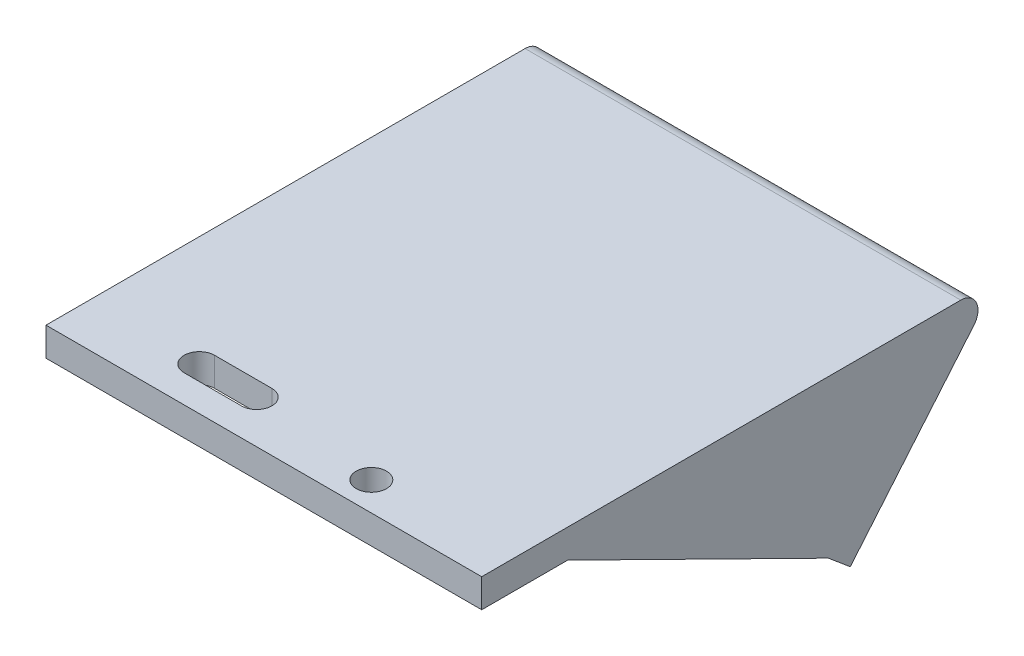
ISO-10303-21;
HEADER;
FILE_DESCRIPTION(('STEP AP214'),'2;1');
FILE_NAME('part.step','',(''),(''),'','','');
FILE_SCHEMA(('AUTOMOTIVE_DESIGN { 1 0 10303 214 1 1 1 1 }'));
ENDSEC;
DATA;
#1=APPLICATION_CONTEXT('core data for automotive mechanical design processes');
#2=APPLICATION_PROTOCOL_DEFINITION('international standard','automotive_design',2000,#1);
#3=PRODUCT_CONTEXT('',#1,'mechanical');
#4=PRODUCT('Part','Part','',(#3));
#5=PRODUCT_RELATED_PRODUCT_CATEGORY('part','',(#4));
#6=PRODUCT_DEFINITION_FORMATION('','',#4);
#7=PRODUCT_DEFINITION_CONTEXT('part definition',#1,'design');
#8=PRODUCT_DEFINITION('design','',#6,#7);
#9=PRODUCT_DEFINITION_SHAPE('','',#8);
#10=(LENGTH_UNIT() NAMED_UNIT(*) SI_UNIT(.MILLI.,.METRE.));
#11=(NAMED_UNIT(*) PLANE_ANGLE_UNIT() SI_UNIT($,.RADIAN.));
#12=(NAMED_UNIT(*) SI_UNIT($,.STERADIAN.) SOLID_ANGLE_UNIT());
#13=UNCERTAINTY_MEASURE_WITH_UNIT(LENGTH_MEASURE(1.E-05),#10,'distance_accuracy_value','');
#14=(GEOMETRIC_REPRESENTATION_CONTEXT(3) GLOBAL_UNCERTAINTY_ASSIGNED_CONTEXT((#13)) GLOBAL_UNIT_ASSIGNED_CONTEXT((#10,
#11,#12)) REPRESENTATION_CONTEXT('',''));
#15=CARTESIAN_POINT('',(0.,0.,0.));
#16=DIRECTION('',(0.,0.,1.));
#17=DIRECTION('',(1.,0.,0.));
#18=AXIS2_PLACEMENT_3D('',#15,#16,#17);
#19=CARTESIAN_POINT('',(70.,0.,0.));
#20=DIRECTION('',(0.,0.,-1.));
#21=DIRECTION('',(0.,1.,0.));
#22=AXIS2_PLACEMENT_3D('',#19,#20,#21);
#23=PLANE('',#22);
#24=DIRECTION('',(-1.,0.,0.));
#25=VECTOR('',#24,1.);
#26=CARTESIAN_POINT('',(70.,0.,0.));
#27=LINE('',#26,#25);
#28=CARTESIAN_POINT('',(73.,0.,0.));
#29=VERTEX_POINT('',#28);
#30=CARTESIAN_POINT('',(-3.,0.,0.));
#31=VERTEX_POINT('',#30);
#32=EDGE_CURVE('E258',#29,#31,#27,.T.);
#33=ORIENTED_EDGE('',*,*,#32,.T.);
#34=DIRECTION('',(0.,1.,0.));
#35=VECTOR('',#34,1.);
#36=CARTESIAN_POINT('',(-3.,0.,0.));
#37=LINE('',#36,#35);
#38=CARTESIAN_POINT('',(-3.,-5.,0.));
#39=VERTEX_POINT('',#38);
#40=EDGE_CURVE('E212',#39,#31,#37,.T.);
#41=ORIENTED_EDGE('',*,*,#40,.F.);
#42=DIRECTION('',(-1.,0.,0.));
#43=VECTOR('',#42,1.);
#44=CARTESIAN_POINT('',(70.,-5.,0.));
#45=LINE('',#44,#43);
#46=CARTESIAN_POINT('',(73.,-5.,0.));
#47=VERTEX_POINT('',#46);
#48=EDGE_CURVE('E271',#47,#39,#45,.T.);
#49=ORIENTED_EDGE('',*,*,#48,.F.);
#50=DIRECTION('',(0.,1.,0.));
#51=VECTOR('',#50,1.);
#52=CARTESIAN_POINT('',(73.,0.,0.));
#53=LINE('',#52,#51);
#54=EDGE_CURVE('E182',#47,#29,#53,.T.);
#55=ORIENTED_EDGE('',*,*,#54,.T.);
#56=EDGE_LOOP('',(#33,#41,#49,#55));
#57=FACE_BOUND('',#56,.T.);
#58=ADVANCED_FACE('F37',(#57),#23,.F.);
#59=CARTESIAN_POINT('',(70.,-5.,0.));
#60=DIRECTION('',(0.,1.,0.));
#61=DIRECTION('',(0.,0.,1.));
#62=AXIS2_PLACEMENT_3D('',#59,#60,#61);
#63=PLANE('',#62);
#64=DIRECTION('',(-1.,0.,0.));
#65=VECTOR('',#64,1.);
#66=CARTESIAN_POINT('',(70.,-5.,-10.15));
#67=LINE('',#66,#65);
#68=CARTESIAN_POINT('',(26.25,-5.,-10.15));
#69=VERTEX_POINT('',#68);
#70=CARTESIAN_POINT('',(16.25,-5.,-10.15));
#71=VERTEX_POINT('',#70);
#72=EDGE_CURVE('E175',#69,#71,#67,.T.);
#73=ORIENTED_EDGE('',*,*,#72,.T.);
#74=CARTESIAN_POINT('',(16.25,-5.,-7.49999999999999));
#75=DIRECTION('',(0.,1.,0.));
#76=DIRECTION('',(0.,0.,1.));
#77=AXIS2_PLACEMENT_3D('',#74,#75,#76);
#78=CIRCLE('',#77,2.65);
#79=CARTESIAN_POINT('',(16.25,-5.,-4.85));
#80=VERTEX_POINT('',#79);
#81=EDGE_CURVE('E178',#71,#80,#78,.T.);
#82=ORIENTED_EDGE('',*,*,#81,.T.);
#83=DIRECTION('',(1.,0.,0.));
#84=VECTOR('',#83,1.);
#85=CARTESIAN_POINT('',(70.,-5.,-4.85000000000001));
#86=LINE('',#85,#84);
#87=CARTESIAN_POINT('',(26.25,-5.,-4.85));
#88=VERTEX_POINT('',#87);
#89=EDGE_CURVE('E170',#80,#88,#86,.T.);
#90=ORIENTED_EDGE('',*,*,#89,.T.);
#91=CARTESIAN_POINT('',(26.25,-5.,-7.5));
#92=DIRECTION('',(0.,1.,0.));
#93=DIRECTION('',(0.,0.,1.));
#94=AXIS2_PLACEMENT_3D('',#91,#92,#93);
#95=CIRCLE('',#94,2.65);
#96=EDGE_CURVE('E150',#88,#69,#95,.T.);
#97=ORIENTED_EDGE('',*,*,#96,.T.);
#98=EDGE_LOOP('',(#73,#82,#90,#97));
#99=FACE_BOUND('',#98,.T.);
#100=CARTESIAN_POINT('',(48.75,-5.,-5.));
#101=DIRECTION('',(0.,1.,0.));
#102=DIRECTION('',(0.,0.,1.));
#103=AXIS2_PLACEMENT_3D('',#100,#101,#102);
#104=CIRCLE('',#103,2.65);
#105=CARTESIAN_POINT('',(48.75,-5.,-2.35));
#106=VERTEX_POINT('',#105);
#107=EDGE_CURVE('E241',#106,#106,#104,.T.);
#108=ORIENTED_EDGE('',*,*,#107,.T.);
#109=EDGE_LOOP('',(#108));
#110=FACE_BOUND('',#109,.T.);
#111=ORIENTED_EDGE('',*,*,#48,.T.);
#112=DIRECTION('',(0.,0.,1.));
#113=VECTOR('',#112,1.);
#114=CARTESIAN_POINT('',(-3.,-5.,0.));
#115=LINE('',#114,#113);
#116=CARTESIAN_POINT('',(-3.,-5.,-15.));
#117=VERTEX_POINT('',#116);
#118=EDGE_CURVE('E228',#117,#39,#115,.T.);
#119=ORIENTED_EDGE('',*,*,#118,.F.);
#120=DIRECTION('',(1.,0.,0.));
#121=VECTOR('',#120,1.);
#122=CARTESIAN_POINT('',(-3.,-5.,-15.));
#123=LINE('',#122,#121);
#124=CARTESIAN_POINT('',(0.,-5.,-15.));
#125=VERTEX_POINT('',#124);
#126=EDGE_CURVE('E231',#117,#125,#123,.T.);
#127=ORIENTED_EDGE('',*,*,#126,.T.);
#128=DIRECTION('',(0.,0.,-1.));
#129=VECTOR('',#128,1.);
#130=CARTESIAN_POINT('',(0.,-5.,0.));
#131=LINE('',#130,#129);
#132=CARTESIAN_POINT('',(0.,-5.,-72.8439446359236));
#133=VERTEX_POINT('',#132);
#134=EDGE_CURVE('E259',#125,#133,#131,.T.);
#135=ORIENTED_EDGE('',*,*,#134,.T.);
#136=DIRECTION('',(-1.,0.,0.));
#137=VECTOR('',#136,1.);
#138=CARTESIAN_POINT('',(70.,-5.,-72.8439446359236));
#139=LINE('',#138,#137);
#140=CARTESIAN_POINT('',(70.,-5.,-72.8439446359236));
#141=VERTEX_POINT('',#140);
#142=EDGE_CURVE('E284',#133,#141,#139,.F.);
#143=ORIENTED_EDGE('',*,*,#142,.T.);
#144=DIRECTION('',(0.,0.,-1.));
#145=VECTOR('',#144,1.);
#146=CARTESIAN_POINT('',(70.,-5.,0.));
#147=LINE('',#146,#145);
#148=CARTESIAN_POINT('',(70.,-5.,-15.));
#149=VERTEX_POINT('',#148);
#150=EDGE_CURVE('E251',#149,#141,#147,.T.);
#151=ORIENTED_EDGE('',*,*,#150,.F.);
#152=DIRECTION('',(-1.,0.,0.));
#153=VECTOR('',#152,1.);
#154=CARTESIAN_POINT('',(73.,-5.,-15.));
#155=LINE('',#154,#153);
#156=CARTESIAN_POINT('',(73.,-5.,-15.));
#157=VERTEX_POINT('',#156);
#158=EDGE_CURVE('E208',#157,#149,#155,.T.);
#159=ORIENTED_EDGE('',*,*,#158,.F.);
#160=DIRECTION('',(0.,0.,1.));
#161=VECTOR('',#160,1.);
#162=CARTESIAN_POINT('',(73.,-5.,0.));
#163=LINE('',#162,#161);
#164=EDGE_CURVE('E185',#157,#47,#163,.T.);
#165=ORIENTED_EDGE('',*,*,#164,.T.);
#166=EDGE_LOOP('',(#111,#119,#127,#135,#143,#151,#159,#165));
#167=FACE_BOUND('',#166,.T.);
#168=ADVANCED_FACE('F293',(#99,#110,#167),#63,.F.);
#169=CARTESIAN_POINT('',(70.,-27.4278396763265,-60.4582733969436));
#170=DIRECTION('',(0.,-0.642787609686538,-0.766044443118979));
#171=DIRECTION('',(0.,0.766044443118979,-0.642787609686538));
#172=AXIS2_PLACEMENT_3D('',#169,#170,#171);
#173=PLANE('',#172);
#174=CARTESIAN_POINT('',(12.5,-19.7673952451367,-66.886149493809));
#175=DIRECTION('',(0.,0.642787609686538,0.766044443118979));
#176=DIRECTION('',(0.,-0.766044443118979,0.642787609686538));
#177=AXIS2_PLACEMENT_3D('',#174,#175,#176);
#178=CIRCLE('',#177,1.65000000000001);
#179=CARTESIAN_POINT('',(12.5,-21.031368576283,-65.8255499378262));
#180=VERTEX_POINT('',#179);
#181=EDGE_CURVE('E245',#180,#180,#178,.T.);
#182=ORIENTED_EDGE('',*,*,#181,.F.);
#183=EDGE_LOOP('',(#182));
#184=FACE_BOUND('',#183,.T.);
#185=CARTESIAN_POINT('',(57.5,-19.7673952451367,-66.886149493809));
#186=DIRECTION('',(0.,0.642787609686538,0.766044443118979));
#187=DIRECTION('',(0.,-0.766044443118979,0.642787609686538));
#188=AXIS2_PLACEMENT_3D('',#185,#186,#187);
#189=CIRCLE('',#188,1.65);
#190=CARTESIAN_POINT('',(57.5,-21.031368576283,-65.8255499378262));
#191=VERTEX_POINT('',#190);
#192=EDGE_CURVE('E244',#191,#191,#189,.T.);
#193=ORIENTED_EDGE('',*,*,#192,.F.);
#194=EDGE_LOOP('',(#193));
#195=FACE_BOUND('',#194,.T.);
#196=DIRECTION('',(0.,-0.766044443118979,0.642787609686538));
#197=VECTOR('',#196,1.);
#198=CARTESIAN_POINT('',(70.,-27.4278396763265,-60.4582733969436));
#199=LINE('',#198,#197);
#200=CARTESIAN_POINT('',(70.,-9.92836282905961,-75.1420779652805));
#201=VERTEX_POINT('',#200);
#202=CARTESIAN_POINT('',(70.,-27.4278396763265,-60.4582733969436));
#203=VERTEX_POINT('',#202);
#204=EDGE_CURVE('E254',#201,#203,#199,.T.);
#205=ORIENTED_EDGE('',*,*,#204,.F.);
#206=DIRECTION('',(-1.,0.,0.));
#207=VECTOR('',#206,1.);
#208=CARTESIAN_POINT('',(0.,-9.92836282905961,-75.1420779652805));
#209=LINE('',#208,#207);
#210=CARTESIAN_POINT('',(0.,-9.92836282905961,-75.1420779652805));
#211=VERTEX_POINT('',#210);
#212=EDGE_CURVE('E281',#201,#211,#209,.T.);
#213=ORIENTED_EDGE('',*,*,#212,.T.);
#214=DIRECTION('',(0.,-0.766044443118979,0.642787609686538));
#215=VECTOR('',#214,1.);
#216=CARTESIAN_POINT('',(0.,-27.4278396763265,-60.4582733969436));
#217=LINE('',#216,#215);
#218=CARTESIAN_POINT('',(0.,-27.4278396763265,-60.4582733969436));
#219=VERTEX_POINT('',#218);
#220=EDGE_CURVE('E255',#211,#219,#217,.T.);
#221=ORIENTED_EDGE('',*,*,#220,.T.);
#222=DIRECTION('',(-1.,0.,0.));
#223=VECTOR('',#222,1.);
#224=CARTESIAN_POINT('',(70.,-27.4278396763265,-60.4582733969436));
#225=LINE('',#224,#223);
#226=EDGE_CURVE('E268',#203,#219,#225,.T.);
#227=ORIENTED_EDGE('',*,*,#226,.F.);
#228=EDGE_LOOP('',(#205,#213,#221,#227));
#229=FACE_BOUND('',#228,.T.);
#230=ADVANCED_FACE('F331',(#184,#195,#229),#173,.F.);
#231=CARTESIAN_POINT('',(70.,-30.6417777247592,-64.2884956125385));
#232=DIRECTION('',(0.,0.766044443118979,-0.642787609686538));
#233=DIRECTION('',(0.,0.642787609686538,0.766044443118979));
#234=AXIS2_PLACEMENT_3D('',#231,#232,#233);
#235=PLANE('',#234);
#236=ORIENTED_EDGE('',*,*,#226,.T.);
#237=DIRECTION('',(1.,0.,0.));
#238=VECTOR('',#237,1.);
#239=CARTESIAN_POINT('',(-3.,-27.4278396763265,-60.4582733969436));
#240=LINE('',#239,#238);
#241=CARTESIAN_POINT('',(-3.,-27.4278396763265,-60.4582733969436));
#242=VERTEX_POINT('',#241);
#243=EDGE_CURVE('E236',#242,#219,#240,.T.);
#244=ORIENTED_EDGE('',*,*,#243,.F.);
#245=DIRECTION('',(0.,0.642787609686538,0.766044443118979));
#246=VECTOR('',#245,1.);
#247=CARTESIAN_POINT('',(-3.,13.6745711607901,-11.4743276175264));
#248=LINE('',#247,#246);
#249=CARTESIAN_POINT('',(-3.,-30.6417777247592,-64.2884956125385));
#250=VERTEX_POINT('',#249);
#251=EDGE_CURVE('E224',#250,#242,#248,.T.);
#252=ORIENTED_EDGE('',*,*,#251,.F.);
#253=DIRECTION('',(-1.,0.,0.));
#254=VECTOR('',#253,1.);
#255=CARTESIAN_POINT('',(70.,-30.6417777247592,-64.2884956125385));
#256=LINE('',#255,#254);
#257=CARTESIAN_POINT('',(73.,-30.6417777247592,-64.2884956125385));
#258=VERTEX_POINT('',#257);
#259=EDGE_CURVE('E266',#258,#250,#256,.T.);
#260=ORIENTED_EDGE('',*,*,#259,.F.);
#261=DIRECTION('',(0.,0.642787609686538,0.766044443118979));
#262=VECTOR('',#261,1.);
#263=CARTESIAN_POINT('',(73.,13.6745711607901,-11.4743276175264));
#264=LINE('',#263,#262);
#265=CARTESIAN_POINT('',(73.,-27.4278396763265,-60.4582733969436));
#266=VERTEX_POINT('',#265);
#267=EDGE_CURVE('E191',#258,#266,#264,.T.);
#268=ORIENTED_EDGE('',*,*,#267,.T.);
#269=DIRECTION('',(-1.,0.,0.));
#270=VECTOR('',#269,1.);
#271=CARTESIAN_POINT('',(73.,-27.4278396763265,-60.4582733969436));
#272=LINE('',#271,#270);
#273=EDGE_CURVE('E203',#266,#203,#272,.T.);
#274=ORIENTED_EDGE('',*,*,#273,.T.);
#275=EDGE_LOOP('',(#236,#244,#252,#260,#268,#274));
#276=FACE_BOUND('',#275,.T.);
#277=ADVANCED_FACE('F310',(#276),#235,.F.);
#278=CARTESIAN_POINT('',(70.,0.,-90.));
#279=DIRECTION('',(0.,0.642787609686538,0.76604444311898));
#280=DIRECTION('',(0.,-0.76604444311898,0.642787609686538));
#281=AXIS2_PLACEMENT_3D('',#278,#279,#280);
#282=PLANE('',#281);
#283=CARTESIAN_POINT('',(12.5,-22.9813332935694,-70.7163717094039));
#284=DIRECTION('',(0.,0.642787609686538,0.76604444311898));
#285=DIRECTION('',(0.,-0.76604444311898,0.642787609686538));
#286=AXIS2_PLACEMENT_3D('',#283,#284,#285);
#287=CIRCLE('',#286,1.65000000000001);
#288=CARTESIAN_POINT('',(12.5,-24.2453066247157,-69.6557721534211));
#289=VERTEX_POINT('',#288);
#290=EDGE_CURVE('E262',#289,#289,#287,.T.);
#291=ORIENTED_EDGE('',*,*,#290,.T.);
#292=EDGE_LOOP('',(#291));
#293=FACE_BOUND('',#292,.T.);
#294=CARTESIAN_POINT('',(57.5,-22.9813332935694,-70.7163717094039));
#295=DIRECTION('',(0.,0.642787609686538,0.76604444311898));
#296=DIRECTION('',(0.,-0.76604444311898,0.642787609686538));
#297=AXIS2_PLACEMENT_3D('',#294,#295,#296);
#298=CIRCLE('',#297,1.65);
#299=CARTESIAN_POINT('',(57.5,-24.2453066247157,-69.6557721534211));
#300=VERTEX_POINT('',#299);
#301=EDGE_CURVE('E248',#300,#300,#298,.T.);
#302=ORIENTED_EDGE('',*,*,#301,.T.);
#303=EDGE_LOOP('',(#302));
#304=FACE_BOUND('',#303,.T.);
#305=ORIENTED_EDGE('',*,*,#259,.T.);
#306=DIRECTION('',(0.,-0.766044443118979,0.642787609686538));
#307=VECTOR('',#306,1.);
#308=CARTESIAN_POINT('',(-3.,-44.3163488855493,-52.8141679950121));
#309=LINE('',#308,#307);
#310=CARTESIAN_POINT('',(-3.,-4.92836282905962,-85.8646125678283));
#311=VERTEX_POINT('',#310);
#312=EDGE_CURVE('E221',#311,#250,#309,.T.);
#313=ORIENTED_EDGE('',*,*,#312,.F.);
#314=DIRECTION('',(-1.,0.,0.));
#315=VECTOR('',#314,1.);
#316=CARTESIAN_POINT('',(70.,-4.92836282905961,-85.8646125678283));
#317=LINE('',#316,#315);
#318=CARTESIAN_POINT('',(73.,-4.92836282905962,-85.8646125678283));
#319=VERTEX_POINT('',#318);
#320=EDGE_CURVE('E279',#311,#319,#317,.F.);
#321=ORIENTED_EDGE('',*,*,#320,.T.);
#322=DIRECTION('',(0.,-0.766044443118979,0.642787609686538));
#323=VECTOR('',#322,1.);
#324=CARTESIAN_POINT('',(73.,-44.3163488855493,-52.8141679950121));
#325=LINE('',#324,#323);
#326=EDGE_CURVE('E194',#319,#258,#325,.T.);
#327=ORIENTED_EDGE('',*,*,#326,.T.);
#328=EDGE_LOOP('',(#305,#313,#321,#327));
#329=FACE_BOUND('',#328,.T.);
#330=ADVANCED_FACE('F315',(#293,#304,#329),#282,.F.);
#331=CARTESIAN_POINT('',(70.,0.,0.));
#332=DIRECTION('',(0.,-1.,0.));
#333=DIRECTION('',(0.,0.,-1.));
#334=AXIS2_PLACEMENT_3D('',#331,#332,#333);
#335=PLANE('',#334);
#336=DIRECTION('',(1.,0.,0.));
#337=VECTOR('',#336,1.);
#338=CARTESIAN_POINT('',(16.25,0.,-4.85));
#339=LINE('',#338,#337);
#340=CARTESIAN_POINT('',(16.25,0.,-4.85));
#341=VERTEX_POINT('',#340);
#342=CARTESIAN_POINT('',(26.25,0.,-4.85));
#343=VERTEX_POINT('',#342);
#344=EDGE_CURVE('E156',#341,#343,#339,.T.);
#345=ORIENTED_EDGE('',*,*,#344,.F.);
#346=CARTESIAN_POINT('',(16.25,0.,-7.49999999999999));
#347=DIRECTION('',(0.,1.,0.));
#348=DIRECTION('',(0.,0.,1.));
#349=AXIS2_PLACEMENT_3D('',#346,#347,#348);
#350=CIRCLE('',#349,2.65);
#351=CARTESIAN_POINT('',(16.25,0.,-10.15));
#352=VERTEX_POINT('',#351);
#353=EDGE_CURVE('E60',#352,#341,#350,.T.);
#354=ORIENTED_EDGE('',*,*,#353,.F.);
#355=DIRECTION('',(-1.,0.,0.));
#356=VECTOR('',#355,1.);
#357=CARTESIAN_POINT('',(16.25,0.,-10.15));
#358=LINE('',#357,#356);
#359=CARTESIAN_POINT('',(26.25,0.,-10.15));
#360=VERTEX_POINT('',#359);
#361=EDGE_CURVE('E163',#360,#352,#358,.T.);
#362=ORIENTED_EDGE('',*,*,#361,.F.);
#363=CARTESIAN_POINT('',(26.25,0.,-7.5));
#364=DIRECTION('',(0.,1.,0.));
#365=DIRECTION('',(0.,0.,1.));
#366=AXIS2_PLACEMENT_3D('',#363,#364,#365);
#367=CIRCLE('',#366,2.65);
#368=EDGE_CURVE('E147',#343,#360,#367,.T.);
#369=ORIENTED_EDGE('',*,*,#368,.F.);
#370=EDGE_LOOP('',(#345,#354,#362,#369));
#371=FACE_BOUND('',#370,.T.);
#372=CARTESIAN_POINT('',(48.75,0.,-5.));
#373=DIRECTION('',(0.,1.,0.));
#374=DIRECTION('',(0.,0.,1.));
#375=AXIS2_PLACEMENT_3D('',#372,#373,#374);
#376=CIRCLE('',#375,2.65);
#377=CARTESIAN_POINT('',(48.75,0.,-2.35));
#378=VERTEX_POINT('',#377);
#379=EDGE_CURVE('E238',#378,#378,#376,.T.);
#380=ORIENTED_EDGE('',*,*,#379,.F.);
#381=EDGE_LOOP('',(#380));
#382=FACE_BOUND('',#381,.T.);
#383=ORIENTED_EDGE('',*,*,#32,.F.);
#384=DIRECTION('',(0.,0.,-1.));
#385=VECTOR('',#384,1.);
#386=CARTESIAN_POINT('',(73.,0.,0.));
#387=LINE('',#386,#385);
#388=CARTESIAN_POINT('',(73.,0.,-83.5664792384713));
#389=VERTEX_POINT('',#388);
#390=EDGE_CURVE('E200',#29,#389,#387,.T.);
#391=ORIENTED_EDGE('',*,*,#390,.T.);
#392=DIRECTION('',(-1.,0.,0.));
#393=VECTOR('',#392,1.);
#394=CARTESIAN_POINT('',(70.,0.,-83.5664792384713));
#395=LINE('',#394,#393);
#396=CARTESIAN_POINT('',(-3.,0.,-83.5664792384713));
#397=VERTEX_POINT('',#396);
#398=EDGE_CURVE('E273',#389,#397,#395,.T.);
#399=ORIENTED_EDGE('',*,*,#398,.T.);
#400=DIRECTION('',(0.,0.,-1.));
#401=VECTOR('',#400,1.);
#402=CARTESIAN_POINT('',(-3.,0.,0.));
#403=LINE('',#402,#401);
#404=EDGE_CURVE('E215',#31,#397,#403,.T.);
#405=ORIENTED_EDGE('',*,*,#404,.F.);
#406=EDGE_LOOP('',(#383,#391,#399,#405));
#407=FACE_BOUND('',#406,.T.);
#408=ADVANCED_FACE('F160',(#371,#382,#407),#335,.F.);
#409=CARTESIAN_POINT('',(57.5,-35.6417777247591,-85.8045018441137));
#410=DIRECTION('',(0.,0.642787609686538,0.766044443118979));
#411=DIRECTION('',(0.,-0.766044443118979,0.642787609686538));
#412=AXIS2_PLACEMENT_3D('',#409,#410,#411);
#413=CYLINDRICAL_SURFACE('',#412,1.65);
#414=ORIENTED_EDGE('',*,*,#192,.T.);
#415=EDGE_LOOP('',(#414));
#416=FACE_BOUND('',#415,.T.);
#417=ORIENTED_EDGE('',*,*,#301,.F.);
#418=EDGE_LOOP('',(#417));
#419=FACE_BOUND('',#418,.T.);
#420=ADVANCED_FACE('F355',(#416,#419),#413,.F.);
#421=CARTESIAN_POINT('',(12.5,-35.6417777247591,-85.8045018441137));
#422=DIRECTION('',(0.,0.642787609686538,0.766044443118979));
#423=DIRECTION('',(0.,-0.766044443118979,0.642787609686538));
#424=AXIS2_PLACEMENT_3D('',#421,#422,#423);
#425=CYLINDRICAL_SURFACE('',#424,1.65000000000001);
#426=ORIENTED_EDGE('',*,*,#181,.T.);
#427=EDGE_LOOP('',(#426));
#428=FACE_BOUND('',#427,.T.);
#429=ORIENTED_EDGE('',*,*,#290,.F.);
#430=EDGE_LOOP('',(#429));
#431=FACE_BOUND('',#430,.T.);
#432=ADVANCED_FACE('F349',(#428,#431),#425,.F.);
#433=CARTESIAN_POINT('',(70.,-3.,-83.5664792384713));
#434=DIRECTION('',(-1.,0.,0.));
#435=DIRECTION('',(0.,0.,1.));
#436=AXIS2_PLACEMENT_3D('',#433,#434,#435);
#437=CYLINDRICAL_SURFACE('',#436,3.);
#438=ORIENTED_EDGE('',*,*,#398,.F.);
#439=CARTESIAN_POINT('',(73.,-3.,-83.5664792384713));
#440=DIRECTION('',(-1.,0.,0.));
#441=DIRECTION('',(0.,0.,1.));
#442=AXIS2_PLACEMENT_3D('',#439,#440,#441);
#443=CIRCLE('',#442,3.);
#444=EDGE_CURVE('E197',#389,#319,#443,.T.);
#445=ORIENTED_EDGE('',*,*,#444,.T.);
#446=ORIENTED_EDGE('',*,*,#320,.F.);
#447=CARTESIAN_POINT('',(-3.,-3.,-83.5664792384713));
#448=DIRECTION('',(-1.,0.,0.));
#449=DIRECTION('',(0.,0.,1.));
#450=AXIS2_PLACEMENT_3D('',#447,#448,#449);
#451=CIRCLE('',#450,3.);
#452=EDGE_CURVE('E218',#397,#311,#451,.T.);
#453=ORIENTED_EDGE('',*,*,#452,.F.);
#454=EDGE_LOOP('',(#438,#445,#446,#453));
#455=FACE_BOUND('',#454,.T.);
#456=ADVANCED_FACE('F321',(#455),#437,.T.);
#457=CARTESIAN_POINT('',(70.,-8.,-72.8439446359236));
#458=DIRECTION('',(1.,0.,0.));
#459=DIRECTION('',(0.,0.,-1.));
#460=AXIS2_PLACEMENT_3D('',#457,#458,#459);
#461=CYLINDRICAL_SURFACE('',#460,3.);
#462=CARTESIAN_POINT('',(70.,-8.,-72.8439446359236));
#463=DIRECTION('',(1.,0.,0.));
#464=DIRECTION('',(0.,0.,-1.));
#465=AXIS2_PLACEMENT_3D('',#462,#463,#464);
#466=CIRCLE('',#465,3.);
#467=EDGE_CURVE('E11',#141,#201,#466,.F.);
#468=ORIENTED_EDGE('',*,*,#467,.F.);
#469=ORIENTED_EDGE('',*,*,#142,.F.);
#470=CARTESIAN_POINT('',(0.,-8.,-72.8439446359236));
#471=DIRECTION('',(1.,0.,0.));
#472=DIRECTION('',(0.,0.,-1.));
#473=AXIS2_PLACEMENT_3D('',#470,#471,#472);
#474=CIRCLE('',#473,3.);
#475=EDGE_CURVE('E45',#211,#133,#474,.T.);
#476=ORIENTED_EDGE('',*,*,#475,.F.);
#477=ORIENTED_EDGE('',*,*,#212,.F.);
#478=EDGE_LOOP('',(#468,#469,#476,#477));
#479=FACE_BOUND('',#478,.T.);
#480=ADVANCED_FACE('F39',(#479),#461,.F.);
#481=CARTESIAN_POINT('',(48.75,-30.6417777247592,-5.));
#482=DIRECTION('',(0.,1.,0.));
#483=DIRECTION('',(0.,0.,1.));
#484=AXIS2_PLACEMENT_3D('',#481,#482,#483);
#485=CYLINDRICAL_SURFACE('',#484,2.65);
#486=ORIENTED_EDGE('',*,*,#379,.T.);
#487=EDGE_LOOP('',(#486));
#488=FACE_BOUND('',#487,.T.);
#489=ORIENTED_EDGE('',*,*,#107,.F.);
#490=EDGE_LOOP('',(#489));
#491=FACE_BOUND('',#490,.T.);
#492=ADVANCED_FACE('F354',(#488,#491),#485,.F.);
#493=CARTESIAN_POINT('',(-3.,1.93063323428507,-0.952520397645471));
#494=DIRECTION('',(0.,0.896792122766235,-0.442452131359348));
#495=DIRECTION('',(0.,0.442452131359348,0.896792122766235));
#496=AXIS2_PLACEMENT_3D('',#493,#494,#495);
#497=PLANE('',#496);
#498=DIRECTION('',(0.,0.442452131359348,0.896792122766235));
#499=VECTOR('',#498,1.);
#500=CARTESIAN_POINT('',(0.,1.93063323428507,-0.952520397645471));
#501=LINE('',#500,#499);
#502=EDGE_CURVE('E211',#219,#125,#501,.T.);
#503=ORIENTED_EDGE('',*,*,#502,.T.);
#504=ORIENTED_EDGE('',*,*,#126,.F.);
#505=DIRECTION('',(0.,0.442452131359348,0.896792122766235));
#506=VECTOR('',#505,1.);
#507=CARTESIAN_POINT('',(-3.,1.93063323428507,-0.952520397645471));
#508=LINE('',#507,#506);
#509=EDGE_CURVE('E226',#242,#117,#508,.T.);
#510=ORIENTED_EDGE('',*,*,#509,.F.);
#511=ORIENTED_EDGE('',*,*,#243,.T.);
#512=EDGE_LOOP('',(#503,#504,#510,#511));
#513=FACE_BOUND('',#512,.T.);
#514=ADVANCED_FACE('F329',(#513),#497,.F.);
#515=CARTESIAN_POINT('',(-3.,0.,0.));
#516=DIRECTION('',(-1.,0.,0.));
#517=DIRECTION('',(0.,0.,1.));
#518=AXIS2_PLACEMENT_3D('',#515,#516,#517);
#519=PLANE('',#518);
#520=ORIENTED_EDGE('',*,*,#40,.T.);
#521=ORIENTED_EDGE('',*,*,#404,.T.);
#522=ORIENTED_EDGE('',*,*,#452,.T.);
#523=ORIENTED_EDGE('',*,*,#312,.T.);
#524=ORIENTED_EDGE('',*,*,#251,.T.);
#525=ORIENTED_EDGE('',*,*,#509,.T.);
#526=ORIENTED_EDGE('',*,*,#118,.T.);
#527=EDGE_LOOP('',(#520,#521,#522,#523,#524,#525,#526));
#528=FACE_BOUND('',#527,.T.);
#529=ADVANCED_FACE('F317',(#528),#519,.T.);
#530=CARTESIAN_POINT('',(0.,0.,0.));
#531=DIRECTION('',(-1.,0.,0.));
#532=DIRECTION('',(0.,0.,1.));
#533=AXIS2_PLACEMENT_3D('',#530,#531,#532);
#534=PLANE('',#533);
#535=ORIENTED_EDGE('',*,*,#220,.F.);
#536=ORIENTED_EDGE('',*,*,#475,.T.);
#537=ORIENTED_EDGE('',*,*,#134,.F.);
#538=ORIENTED_EDGE('',*,*,#502,.F.);
#539=EDGE_LOOP('',(#535,#536,#537,#538));
#540=FACE_BOUND('',#539,.T.);
#541=ADVANCED_FACE('F287',(#540),#534,.F.);
#542=CARTESIAN_POINT('',(70.,0.,0.));
#543=DIRECTION('',(1.,0.,0.));
#544=DIRECTION('',(0.,0.,1.));
#545=AXIS2_PLACEMENT_3D('',#542,#543,#544);
#546=PLANE('',#545);
#547=DIRECTION('',(0.,0.442452131359348,0.896792122766235));
#548=VECTOR('',#547,1.);
#549=CARTESIAN_POINT('',(70.,1.93063323428507,-0.952520397645471));
#550=LINE('',#549,#548);
#551=EDGE_CURVE('E181',#203,#149,#550,.T.);
#552=ORIENTED_EDGE('',*,*,#551,.T.);
#553=ORIENTED_EDGE('',*,*,#150,.T.);
#554=ORIENTED_EDGE('',*,*,#467,.T.);
#555=ORIENTED_EDGE('',*,*,#204,.T.);
#556=EDGE_LOOP('',(#552,#553,#554,#555));
#557=FACE_BOUND('',#556,.T.);
#558=ADVANCED_FACE('F298',(#557),#546,.F.);
#559=CARTESIAN_POINT('',(73.,1.93063323428507,-0.952520397645471));
#560=DIRECTION('',(0.,-0.896792122766235,0.442452131359348));
#561=DIRECTION('',(0.,-0.442452131359348,-0.896792122766235));
#562=AXIS2_PLACEMENT_3D('',#559,#560,#561);
#563=PLANE('',#562);
#564=ORIENTED_EDGE('',*,*,#551,.F.);
#565=ORIENTED_EDGE('',*,*,#273,.F.);
#566=DIRECTION('',(0.,0.442452131359348,0.896792122766235));
#567=VECTOR('',#566,1.);
#568=CARTESIAN_POINT('',(73.,1.93063323428507,-0.952520397645471));
#569=LINE('',#568,#567);
#570=EDGE_CURVE('E188',#266,#157,#569,.T.);
#571=ORIENTED_EDGE('',*,*,#570,.T.);
#572=ORIENTED_EDGE('',*,*,#158,.T.);
#573=EDGE_LOOP('',(#564,#565,#571,#572));
#574=FACE_BOUND('',#573,.T.);
#575=ADVANCED_FACE('F302',(#574),#563,.T.);
#576=CARTESIAN_POINT('',(73.,0.,0.));
#577=DIRECTION('',(1.,0.,0.));
#578=DIRECTION('',(0.,0.,1.));
#579=AXIS2_PLACEMENT_3D('',#576,#577,#578);
#580=PLANE('',#579);
#581=ORIENTED_EDGE('',*,*,#54,.F.);
#582=ORIENTED_EDGE('',*,*,#164,.F.);
#583=ORIENTED_EDGE('',*,*,#570,.F.);
#584=ORIENTED_EDGE('',*,*,#267,.F.);
#585=ORIENTED_EDGE('',*,*,#326,.F.);
#586=ORIENTED_EDGE('',*,*,#444,.F.);
#587=ORIENTED_EDGE('',*,*,#390,.F.);
#588=EDGE_LOOP('',(#581,#582,#583,#584,#585,#586,#587));
#589=FACE_BOUND('',#588,.T.);
#590=ADVANCED_FACE('F307',(#589),#580,.T.);
#591=CARTESIAN_POINT('',(16.25,-30.6417777247592,-7.49999999999999));
#592=DIRECTION('',(0.,1.,0.));
#593=DIRECTION('',(0.,0.,1.));
#594=AXIS2_PLACEMENT_3D('',#591,#592,#593);
#595=CYLINDRICAL_SURFACE('',#594,2.65);
#596=DIRECTION('',(0.,1.,0.));
#597=VECTOR('',#596,1.);
#598=CARTESIAN_POINT('',(16.25,-30.6417777247592,-10.15));
#599=LINE('',#598,#597);
#600=EDGE_CURVE('E168',#71,#352,#599,.T.);
#601=ORIENTED_EDGE('',*,*,#600,.T.);
#602=ORIENTED_EDGE('',*,*,#353,.T.);
#603=DIRECTION('',(0.,1.,0.));
#604=VECTOR('',#603,1.);
#605=CARTESIAN_POINT('',(16.25,-30.6417777247592,-4.85));
#606=LINE('',#605,#604);
#607=EDGE_CURVE('E153',#80,#341,#606,.T.);
#608=ORIENTED_EDGE('',*,*,#607,.F.);
#609=ORIENTED_EDGE('',*,*,#81,.F.);
#610=EDGE_LOOP('',(#601,#602,#608,#609));
#611=FACE_BOUND('',#610,.T.);
#612=ADVANCED_FACE('F508',(#611),#595,.F.);
#613=CARTESIAN_POINT('',(16.25,-30.6417777247592,-10.15));
#614=DIRECTION('',(0.,0.,-1.));
#615=DIRECTION('',(-1.,0.,0.));
#616=AXIS2_PLACEMENT_3D('',#613,#614,#615);
#617=PLANE('',#616);
#618=DIRECTION('',(0.,1.,0.));
#619=VECTOR('',#618,1.);
#620=CARTESIAN_POINT('',(26.25,-30.6417777247592,-10.15));
#621=LINE('',#620,#619);
#622=EDGE_CURVE('E152',#69,#360,#621,.T.);
#623=ORIENTED_EDGE('',*,*,#622,.T.);
#624=ORIENTED_EDGE('',*,*,#361,.T.);
#625=ORIENTED_EDGE('',*,*,#600,.F.);
#626=ORIENTED_EDGE('',*,*,#72,.F.);
#627=EDGE_LOOP('',(#623,#624,#625,#626));
#628=FACE_BOUND('',#627,.T.);
#629=ADVANCED_FACE('F518',(#628),#617,.F.);
#630=CARTESIAN_POINT('',(26.25,-30.6417777247592,-7.5));
#631=DIRECTION('',(0.,1.,0.));
#632=DIRECTION('',(0.,0.,1.));
#633=AXIS2_PLACEMENT_3D('',#630,#631,#632);
#634=CYLINDRICAL_SURFACE('',#633,2.65);
#635=DIRECTION('',(0.,1.,0.));
#636=VECTOR('',#635,1.);
#637=CARTESIAN_POINT('',(26.25,-30.6417777247592,-4.85));
#638=LINE('',#637,#636);
#639=EDGE_CURVE('E52',#88,#343,#638,.T.);
#640=ORIENTED_EDGE('',*,*,#639,.T.);
#641=ORIENTED_EDGE('',*,*,#368,.T.);
#642=ORIENTED_EDGE('',*,*,#622,.F.);
#643=ORIENTED_EDGE('',*,*,#96,.F.);
#644=EDGE_LOOP('',(#640,#641,#642,#643));
#645=FACE_BOUND('',#644,.T.);
#646=ADVANCED_FACE('F144',(#645),#634,.F.);
#647=CARTESIAN_POINT('',(16.25,-30.6417777247592,-4.85));
#648=DIRECTION('',(0.,0.,1.));
#649=DIRECTION('',(1.,0.,0.));
#650=AXIS2_PLACEMENT_3D('',#647,#648,#649);
#651=PLANE('',#650);
#652=ORIENTED_EDGE('',*,*,#607,.T.);
#653=ORIENTED_EDGE('',*,*,#344,.T.);
#654=ORIENTED_EDGE('',*,*,#639,.F.);
#655=ORIENTED_EDGE('',*,*,#89,.F.);
#656=EDGE_LOOP('',(#652,#653,#654,#655));
#657=FACE_BOUND('',#656,.T.);
#658=ADVANCED_FACE('F157',(#657),#651,.F.);
#659=CLOSED_SHELL('',(#58,#168,#230,#277,#330,#408,#420,#432,#456,#480,#492,#514,#529,#541,#558,
#575,#590,#612,#629,#646,#658));
#660=MANIFOLD_SOLID_BREP('B2',#659);
#661=ADVANCED_BREP_SHAPE_REPRESENTATION('',(#18,#660),#14);
#662=SHAPE_DEFINITION_REPRESENTATION(#9,#661);
ENDSEC;
END-ISO-10303-21;
